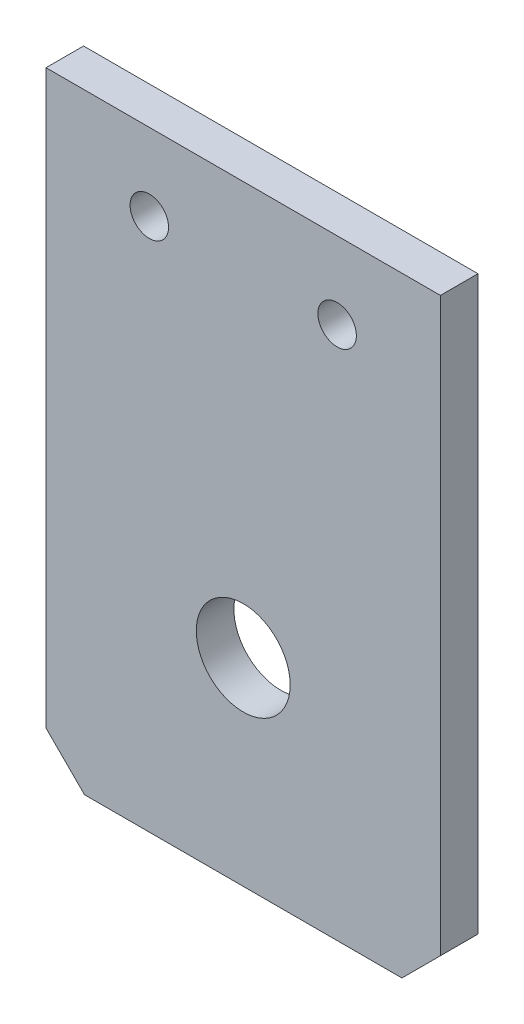
ISO-10303-21;
HEADER;
FILE_DESCRIPTION(('STEP AP214'),'2;1');
FILE_NAME('part.step','',(''),(''),'','','');
FILE_SCHEMA(('AUTOMOTIVE_DESIGN { 1 0 10303 214 1 1 1 1 }'));
ENDSEC;
DATA;
#1=APPLICATION_CONTEXT('core data for automotive mechanical design processes');
#2=APPLICATION_PROTOCOL_DEFINITION('international standard','automotive_design',2000,#1);
#3=PRODUCT_CONTEXT('',#1,'mechanical');
#4=PRODUCT('Part','Part','',(#3));
#5=PRODUCT_RELATED_PRODUCT_CATEGORY('part','',(#4));
#6=PRODUCT_DEFINITION_FORMATION('','',#4);
#7=PRODUCT_DEFINITION_CONTEXT('part definition',#1,'design');
#8=PRODUCT_DEFINITION('design','',#6,#7);
#9=PRODUCT_DEFINITION_SHAPE('','',#8);
#10=(LENGTH_UNIT() NAMED_UNIT(*) SI_UNIT(.MILLI.,.METRE.));
#11=(NAMED_UNIT(*) PLANE_ANGLE_UNIT() SI_UNIT($,.RADIAN.));
#12=(NAMED_UNIT(*) SI_UNIT($,.STERADIAN.) SOLID_ANGLE_UNIT());
#13=UNCERTAINTY_MEASURE_WITH_UNIT(LENGTH_MEASURE(1.E-05),#10,'distance_accuracy_value','');
#14=(GEOMETRIC_REPRESENTATION_CONTEXT(3) GLOBAL_UNCERTAINTY_ASSIGNED_CONTEXT((#13)) GLOBAL_UNIT_ASSIGNED_CONTEXT((#10,
#11,#12)) REPRESENTATION_CONTEXT('',''));
#15=CARTESIAN_POINT('',(0.,0.,0.));
#16=DIRECTION('',(0.,0.,1.));
#17=DIRECTION('',(1.,0.,0.));
#18=AXIS2_PLACEMENT_3D('',#15,#16,#17);
#19=CARTESIAN_POINT('',(0.,0.,4.));
#20=DIRECTION('',(0.,0.,1.));
#21=DIRECTION('',(1.,0.,0.));
#22=AXIS2_PLACEMENT_3D('',#19,#20,#21);
#23=PLANE('',#22);
#24=CARTESIAN_POINT('',(21.,21.08,4.));
#25=DIRECTION('',(0.,0.,1.));
#26=DIRECTION('',(1.,0.,0.));
#27=AXIS2_PLACEMENT_3D('',#24,#25,#26);
#28=CIRCLE('',#27,5.);
#29=CARTESIAN_POINT('',(26.,21.08,4.));
#30=VERTEX_POINT('',#29);
#31=EDGE_CURVE('E157',#30,#30,#28,.T.);
#32=ORIENTED_EDGE('',*,*,#31,.F.);
#33=EDGE_LOOP('',(#32));
#34=FACE_BOUND('',#33,.T.);
#35=CARTESIAN_POINT('',(11.,56.8,4.));
#36=DIRECTION('',(0.,0.,1.));
#37=DIRECTION('',(1.,0.,0.));
#38=AXIS2_PLACEMENT_3D('',#35,#36,#37);
#39=CIRCLE('',#38,2.04999999999999);
#40=CARTESIAN_POINT('',(13.05,56.8,4.));
#41=VERTEX_POINT('',#40);
#42=EDGE_CURVE('E117',#41,#41,#39,.T.);
#43=ORIENTED_EDGE('',*,*,#42,.F.);
#44=EDGE_LOOP('',(#43));
#45=FACE_BOUND('',#44,.T.);
#46=DIRECTION('',(1.,0.,0.));
#47=VECTOR('',#46,1.);
#48=CARTESIAN_POINT('',(0.,0.,4.));
#49=LINE('',#48,#47);
#50=CARTESIAN_POINT('',(4.1,0.,4.));
#51=VERTEX_POINT('',#50);
#52=CARTESIAN_POINT('',(37.9,0.,4.));
#53=VERTEX_POINT('',#52);
#54=EDGE_CURVE('E96',#51,#53,#49,.T.);
#55=ORIENTED_EDGE('',*,*,#54,.T.);
#56=DIRECTION('',(-0.707106781186549,-0.707106781186547,0.));
#57=VECTOR('',#56,1.);
#58=CARTESIAN_POINT('',(18.9499999999999,-18.95,4.));
#59=LINE('',#58,#57);
#60=CARTESIAN_POINT('',(42.,4.10000000000004,4.));
#61=VERTEX_POINT('',#60);
#62=EDGE_CURVE('E40',#53,#61,#59,.F.);
#63=ORIENTED_EDGE('',*,*,#62,.T.);
#64=DIRECTION('',(0.,1.,0.));
#65=VECTOR('',#64,1.);
#66=CARTESIAN_POINT('',(42.,65.,4.));
#67=LINE('',#66,#65);
#68=CARTESIAN_POINT('',(42.,65.,4.));
#69=VERTEX_POINT('',#68);
#70=EDGE_CURVE('E86',#61,#69,#67,.T.);
#71=ORIENTED_EDGE('',*,*,#70,.T.);
#72=DIRECTION('',(-1.,0.,0.));
#73=VECTOR('',#72,1.);
#74=CARTESIAN_POINT('',(0.,65.,4.));
#75=LINE('',#74,#73);
#76=CARTESIAN_POINT('',(0.,65.,4.));
#77=VERTEX_POINT('',#76);
#78=EDGE_CURVE('E90',#69,#77,#75,.T.);
#79=ORIENTED_EDGE('',*,*,#78,.T.);
#80=DIRECTION('',(0.,-1.,0.));
#81=VECTOR('',#80,1.);
#82=CARTESIAN_POINT('',(0.,65.,4.));
#83=LINE('',#82,#81);
#84=CARTESIAN_POINT('',(0.,4.1,4.));
#85=VERTEX_POINT('',#84);
#86=EDGE_CURVE('E121',#77,#85,#83,.T.);
#87=ORIENTED_EDGE('',*,*,#86,.T.);
#88=DIRECTION('',(-0.707106781186547,0.707106781186548,0.));
#89=VECTOR('',#88,1.);
#90=CARTESIAN_POINT('',(2.05,2.05,4.));
#91=LINE('',#90,#89);
#92=EDGE_CURVE('E132',#85,#51,#91,.F.);
#93=ORIENTED_EDGE('',*,*,#92,.T.);
#94=EDGE_LOOP('',(#55,#63,#71,#79,#87,#93));
#95=FACE_BOUND('',#94,.T.);
#96=CARTESIAN_POINT('',(31.,56.8,4.));
#97=DIRECTION('',(0.,0.,1.));
#98=DIRECTION('',(1.,0.,0.));
#99=AXIS2_PLACEMENT_3D('',#96,#97,#98);
#100=CIRCLE('',#99,2.04999999999999);
#101=CARTESIAN_POINT('',(33.05,56.8,4.));
#102=VERTEX_POINT('',#101);
#103=EDGE_CURVE('E148',#102,#102,#100,.T.);
#104=ORIENTED_EDGE('',*,*,#103,.F.);
#105=EDGE_LOOP('',(#104));
#106=FACE_BOUND('',#105,.T.);
#107=ADVANCED_FACE('F32',(#34,#45,#95,#106),#23,.T.);
#108=CARTESIAN_POINT('',(0.,0.,0.));
#109=DIRECTION('',(0.,0.,1.));
#110=DIRECTION('',(1.,0.,0.));
#111=AXIS2_PLACEMENT_3D('',#108,#109,#110);
#112=PLANE('',#111);
#113=CARTESIAN_POINT('',(21.,21.08,0.));
#114=DIRECTION('',(0.,0.,1.));
#115=DIRECTION('',(1.,0.,0.));
#116=AXIS2_PLACEMENT_3D('',#113,#114,#115);
#117=CIRCLE('',#116,5.);
#118=CARTESIAN_POINT('',(26.,21.08,0.));
#119=VERTEX_POINT('',#118);
#120=EDGE_CURVE('E154',#119,#119,#117,.T.);
#121=ORIENTED_EDGE('',*,*,#120,.T.);
#122=EDGE_LOOP('',(#121));
#123=FACE_BOUND('',#122,.T.);
#124=DIRECTION('',(0.,1.,0.));
#125=VECTOR('',#124,1.);
#126=CARTESIAN_POINT('',(42.,65.,0.));
#127=LINE('',#126,#125);
#128=CARTESIAN_POINT('',(42.,4.10000000000004,0.));
#129=VERTEX_POINT('',#128);
#130=CARTESIAN_POINT('',(42.,65.,0.));
#131=VERTEX_POINT('',#130);
#132=EDGE_CURVE('E102',#129,#131,#127,.T.);
#133=ORIENTED_EDGE('',*,*,#132,.F.);
#134=DIRECTION('',(0.707106781186549,0.707106781186547,0.));
#135=VECTOR('',#134,1.);
#136=CARTESIAN_POINT('',(42.,4.10000000000001,0.));
#137=LINE('',#136,#135);
#138=CARTESIAN_POINT('',(37.9,0.,0.));
#139=VERTEX_POINT('',#138);
#140=EDGE_CURVE('E126',#129,#139,#137,.F.);
#141=ORIENTED_EDGE('',*,*,#140,.T.);
#142=DIRECTION('',(1.,0.,0.));
#143=VECTOR('',#142,1.);
#144=CARTESIAN_POINT('',(0.,0.,0.));
#145=LINE('',#144,#143);
#146=CARTESIAN_POINT('',(4.1,0.,0.));
#147=VERTEX_POINT('',#146);
#148=EDGE_CURVE('E116',#147,#139,#145,.T.);
#149=ORIENTED_EDGE('',*,*,#148,.F.);
#150=DIRECTION('',(0.707106781186547,-0.707106781186548,0.));
#151=VECTOR('',#150,1.);
#152=CARTESIAN_POINT('',(4.1,0.,0.));
#153=LINE('',#152,#151);
#154=CARTESIAN_POINT('',(0.,4.10000000000001,0.));
#155=VERTEX_POINT('',#154);
#156=EDGE_CURVE('E124',#147,#155,#153,.F.);
#157=ORIENTED_EDGE('',*,*,#156,.T.);
#158=DIRECTION('',(0.,-1.,0.));
#159=VECTOR('',#158,1.);
#160=CARTESIAN_POINT('',(0.,65.,0.));
#161=LINE('',#160,#159);
#162=CARTESIAN_POINT('',(0.,65.,0.));
#163=VERTEX_POINT('',#162);
#164=EDGE_CURVE('E114',#163,#155,#161,.T.);
#165=ORIENTED_EDGE('',*,*,#164,.F.);
#166=DIRECTION('',(-1.,0.,0.));
#167=VECTOR('',#166,1.);
#168=CARTESIAN_POINT('',(0.,65.,0.));
#169=LINE('',#168,#167);
#170=EDGE_CURVE('E120',#131,#163,#169,.T.);
#171=ORIENTED_EDGE('',*,*,#170,.F.);
#172=EDGE_LOOP('',(#133,#141,#149,#157,#165,#171));
#173=FACE_BOUND('',#172,.T.);
#174=CARTESIAN_POINT('',(11.,56.8,0.));
#175=DIRECTION('',(0.,0.,1.));
#176=DIRECTION('',(1.,0.,0.));
#177=AXIS2_PLACEMENT_3D('',#174,#175,#176);
#178=CIRCLE('',#177,2.04999999999999);
#179=CARTESIAN_POINT('',(13.05,56.8,0.));
#180=VERTEX_POINT('',#179);
#181=EDGE_CURVE('E145',#180,#180,#178,.T.);
#182=ORIENTED_EDGE('',*,*,#181,.T.);
#183=EDGE_LOOP('',(#182));
#184=FACE_BOUND('',#183,.T.);
#185=CARTESIAN_POINT('',(31.,56.8,0.));
#186=DIRECTION('',(0.,0.,1.));
#187=DIRECTION('',(1.,0.,0.));
#188=AXIS2_PLACEMENT_3D('',#185,#186,#187);
#189=CIRCLE('',#188,2.04999999999999);
#190=CARTESIAN_POINT('',(33.05,56.8,0.));
#191=VERTEX_POINT('',#190);
#192=EDGE_CURVE('E151',#191,#191,#189,.T.);
#193=ORIENTED_EDGE('',*,*,#192,.T.);
#194=EDGE_LOOP('',(#193));
#195=FACE_BOUND('',#194,.T.);
#196=ADVANCED_FACE('F140',(#123,#173,#184,#195),#112,.F.);
#197=CARTESIAN_POINT('',(0.,65.,4.));
#198=DIRECTION('',(1.,0.,0.));
#199=DIRECTION('',(0.,1.,0.));
#200=AXIS2_PLACEMENT_3D('',#197,#198,#199);
#201=PLANE('',#200);
#202=ORIENTED_EDGE('',*,*,#164,.T.);
#203=DIRECTION('',(0.,0.,1.));
#204=VECTOR('',#203,1.);
#205=CARTESIAN_POINT('',(0.,4.10000000000001,4.));
#206=LINE('',#205,#204);
#207=EDGE_CURVE('E11',#155,#85,#206,.T.);
#208=ORIENTED_EDGE('',*,*,#207,.T.);
#209=ORIENTED_EDGE('',*,*,#86,.F.);
#210=DIRECTION('',(0.,0.,-1.));
#211=VECTOR('',#210,1.);
#212=CARTESIAN_POINT('',(0.,65.,4.));
#213=LINE('',#212,#211);
#214=EDGE_CURVE('E106',#77,#163,#213,.T.);
#215=ORIENTED_EDGE('',*,*,#214,.T.);
#216=EDGE_LOOP('',(#202,#208,#209,#215));
#217=FACE_BOUND('',#216,.T.);
#218=ADVANCED_FACE('F142',(#217),#201,.F.);
#219=CARTESIAN_POINT('',(0.,0.,4.));
#220=DIRECTION('',(0.,1.,0.));
#221=DIRECTION('',(-1.,0.,0.));
#222=AXIS2_PLACEMENT_3D('',#219,#220,#221);
#223=PLANE('',#222);
#224=ORIENTED_EDGE('',*,*,#148,.T.);
#225=DIRECTION('',(0.,0.,1.));
#226=VECTOR('',#225,1.);
#227=CARTESIAN_POINT('',(37.9,0.,4.));
#228=LINE('',#227,#226);
#229=EDGE_CURVE('E53',#139,#53,#228,.T.);
#230=ORIENTED_EDGE('',*,*,#229,.T.);
#231=ORIENTED_EDGE('',*,*,#54,.F.);
#232=DIRECTION('',(0.,0.,-1.));
#233=VECTOR('',#232,1.);
#234=CARTESIAN_POINT('',(4.1,0.,4.));
#235=LINE('',#234,#233);
#236=EDGE_CURVE('E128',#51,#147,#235,.T.);
#237=ORIENTED_EDGE('',*,*,#236,.T.);
#238=EDGE_LOOP('',(#224,#230,#231,#237));
#239=FACE_BOUND('',#238,.T.);
#240=ADVANCED_FACE('F136',(#239),#223,.F.);
#241=CARTESIAN_POINT('',(42.,65.,4.));
#242=DIRECTION('',(-1.,0.,0.));
#243=DIRECTION('',(0.,-1.,0.));
#244=AXIS2_PLACEMENT_3D('',#241,#242,#243);
#245=PLANE('',#244);
#246=ORIENTED_EDGE('',*,*,#70,.F.);
#247=DIRECTION('',(0.,0.,-1.));
#248=VECTOR('',#247,1.);
#249=CARTESIAN_POINT('',(42.,4.10000000000001,4.));
#250=LINE('',#249,#248);
#251=EDGE_CURVE('E105',#61,#129,#250,.T.);
#252=ORIENTED_EDGE('',*,*,#251,.T.);
#253=ORIENTED_EDGE('',*,*,#132,.T.);
#254=DIRECTION('',(0.,0.,-1.));
#255=VECTOR('',#254,1.);
#256=CARTESIAN_POINT('',(42.,65.,4.));
#257=LINE('',#256,#255);
#258=EDGE_CURVE('E99',#69,#131,#257,.T.);
#259=ORIENTED_EDGE('',*,*,#258,.F.);
#260=EDGE_LOOP('',(#246,#252,#253,#259));
#261=FACE_BOUND('',#260,.T.);
#262=ADVANCED_FACE('F100',(#261),#245,.F.);
#263=CARTESIAN_POINT('',(0.,65.,4.));
#264=DIRECTION('',(0.,-1.,0.));
#265=DIRECTION('',(0.,0.,-1.));
#266=AXIS2_PLACEMENT_3D('',#263,#264,#265);
#267=PLANE('',#266);
#268=ORIENTED_EDGE('',*,*,#170,.T.);
#269=ORIENTED_EDGE('',*,*,#214,.F.);
#270=ORIENTED_EDGE('',*,*,#78,.F.);
#271=ORIENTED_EDGE('',*,*,#258,.T.);
#272=EDGE_LOOP('',(#268,#269,#270,#271));
#273=FACE_BOUND('',#272,.T.);
#274=ADVANCED_FACE('F108',(#273),#267,.F.);
#275=CARTESIAN_POINT('',(11.,56.8,4.));
#276=DIRECTION('',(0.,0.,-1.));
#277=DIRECTION('',(-1.,0.,0.));
#278=AXIS2_PLACEMENT_3D('',#275,#276,#277);
#279=CYLINDRICAL_SURFACE('',#278,2.04999999999999);
#280=ORIENTED_EDGE('',*,*,#42,.T.);
#281=EDGE_LOOP('',(#280));
#282=FACE_BOUND('',#281,.T.);
#283=ORIENTED_EDGE('',*,*,#181,.F.);
#284=EDGE_LOOP('',(#283));
#285=FACE_BOUND('',#284,.T.);
#286=ADVANCED_FACE('F175',(#282,#285),#279,.F.);
#287=CARTESIAN_POINT('',(31.,56.8,4.));
#288=DIRECTION('',(0.,0.,-1.));
#289=DIRECTION('',(-1.,0.,0.));
#290=AXIS2_PLACEMENT_3D('',#287,#288,#289);
#291=CYLINDRICAL_SURFACE('',#290,2.04999999999999);
#292=ORIENTED_EDGE('',*,*,#103,.T.);
#293=EDGE_LOOP('',(#292));
#294=FACE_BOUND('',#293,.T.);
#295=ORIENTED_EDGE('',*,*,#192,.F.);
#296=EDGE_LOOP('',(#295));
#297=FACE_BOUND('',#296,.T.);
#298=ADVANCED_FACE('F178',(#294,#297),#291,.F.);
#299=CARTESIAN_POINT('',(42.,4.10000000000001,4.));
#300=DIRECTION('',(-0.707106781186547,0.707106781186549,0.));
#301=DIRECTION('',(0.,0.,-1.));
#302=AXIS2_PLACEMENT_3D('',#299,#300,#301);
#303=PLANE('',#302);
#304=ORIENTED_EDGE('',*,*,#62,.F.);
#305=ORIENTED_EDGE('',*,*,#229,.F.);
#306=ORIENTED_EDGE('',*,*,#140,.F.);
#307=ORIENTED_EDGE('',*,*,#251,.F.);
#308=EDGE_LOOP('',(#304,#305,#306,#307));
#309=FACE_BOUND('',#308,.T.);
#310=ADVANCED_FACE('F187',(#309),#303,.F.);
#311=CARTESIAN_POINT('',(4.1,0.,4.));
#312=DIRECTION('',(0.707106781186548,0.707106781186547,0.));
#313=DIRECTION('',(0.,0.,-1.));
#314=AXIS2_PLACEMENT_3D('',#311,#312,#313);
#315=PLANE('',#314);
#316=ORIENTED_EDGE('',*,*,#92,.F.);
#317=ORIENTED_EDGE('',*,*,#207,.F.);
#318=ORIENTED_EDGE('',*,*,#156,.F.);
#319=ORIENTED_EDGE('',*,*,#236,.F.);
#320=EDGE_LOOP('',(#316,#317,#318,#319));
#321=FACE_BOUND('',#320,.T.);
#322=ADVANCED_FACE('F34',(#321),#315,.F.);
#323=CARTESIAN_POINT('',(21.,21.08,0.));
#324=DIRECTION('',(0.,0.,1.));
#325=DIRECTION('',(1.,0.,0.));
#326=AXIS2_PLACEMENT_3D('',#323,#324,#325);
#327=CYLINDRICAL_SURFACE('',#326,5.);
#328=ORIENTED_EDGE('',*,*,#120,.F.);
#329=EDGE_LOOP('',(#328));
#330=FACE_BOUND('',#329,.T.);
#331=ORIENTED_EDGE('',*,*,#31,.T.);
#332=EDGE_LOOP('',(#331));
#333=FACE_BOUND('',#332,.T.);
#334=ADVANCED_FACE('F164',(#330,#333),#327,.F.);
#335=CLOSED_SHELL('',(#107,#196,#218,#240,#262,#274,#286,#298,#310,#322,#334));
#336=MANIFOLD_SOLID_BREP('B2',#335);
#337=ADVANCED_BREP_SHAPE_REPRESENTATION('',(#18,#336),#14);
#338=SHAPE_DEFINITION_REPRESENTATION(#9,#337);
ENDSEC;
END-ISO-10303-21;
